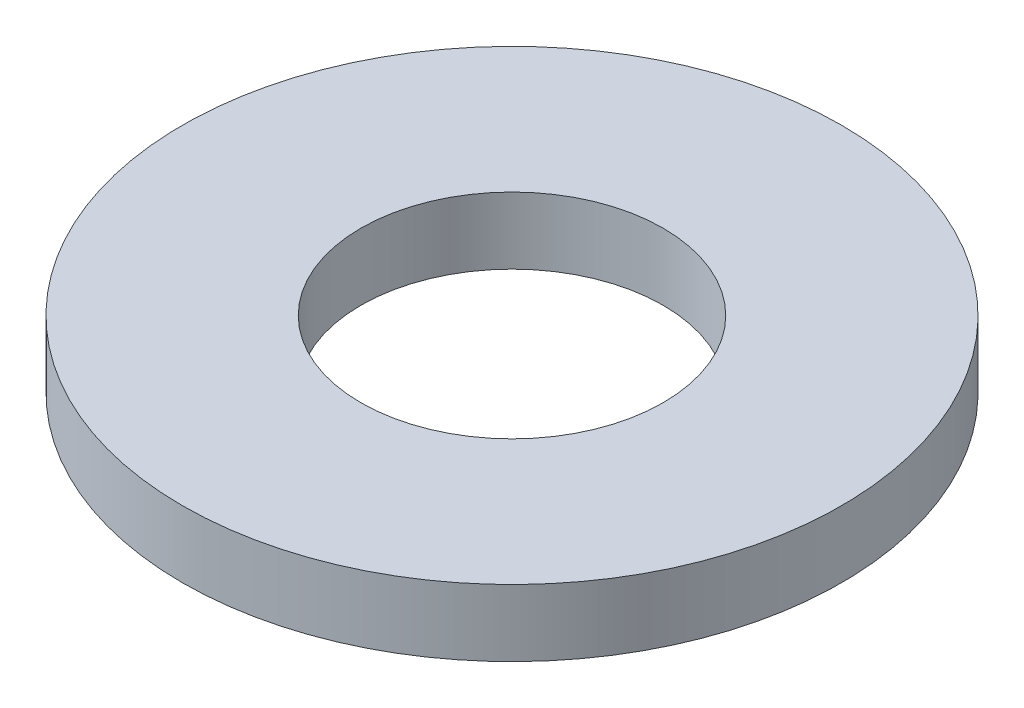
ISO-10303-21;
HEADER;
FILE_DESCRIPTION(('STEP AP214'),'2;1');
FILE_NAME('part.step','',(''),(''),'','','');
FILE_SCHEMA(('AUTOMOTIVE_DESIGN { 1 0 10303 214 1 1 1 1 }'));
ENDSEC;
DATA;
#1=APPLICATION_CONTEXT('core data for automotive mechanical design processes');
#2=APPLICATION_PROTOCOL_DEFINITION('international standard','automotive_design',2000,#1);
#3=PRODUCT_CONTEXT('',#1,'mechanical');
#4=PRODUCT('Part','Part','',(#3));
#5=PRODUCT_RELATED_PRODUCT_CATEGORY('part','',(#4));
#6=PRODUCT_DEFINITION_FORMATION('','',#4);
#7=PRODUCT_DEFINITION_CONTEXT('part definition',#1,'design');
#8=PRODUCT_DEFINITION('design','',#6,#7);
#9=PRODUCT_DEFINITION_SHAPE('','',#8);
#10=(LENGTH_UNIT() NAMED_UNIT(*) SI_UNIT(.MILLI.,.METRE.));
#11=(NAMED_UNIT(*) PLANE_ANGLE_UNIT() SI_UNIT($,.RADIAN.));
#12=(NAMED_UNIT(*) SI_UNIT($,.STERADIAN.) SOLID_ANGLE_UNIT());
#13=UNCERTAINTY_MEASURE_WITH_UNIT(LENGTH_MEASURE(1.E-05),#10,'distance_accuracy_value','');
#14=(GEOMETRIC_REPRESENTATION_CONTEXT(3) GLOBAL_UNCERTAINTY_ASSIGNED_CONTEXT((#13)) GLOBAL_UNIT_ASSIGNED_CONTEXT((#10,
#11,#12)) REPRESENTATION_CONTEXT('',''));
#15=CARTESIAN_POINT('',(0.,0.,0.));
#16=DIRECTION('',(0.,0.,1.));
#17=DIRECTION('',(1.,0.,0.));
#18=AXIS2_PLACEMENT_3D('',#15,#16,#17);
#19=CARTESIAN_POINT('',(0.,0.9652,0.));
#20=DIRECTION('',(0.,-1.,0.));
#21=DIRECTION('',(0.,0.,-1.));
#22=AXIS2_PLACEMENT_3D('',#19,#20,#21);
#23=CYLINDRICAL_SURFACE('',#22,4.7625);
#24=CARTESIAN_POINT('',(0.,0.9652,0.));
#25=DIRECTION('',(0.,1.,0.));
#26=DIRECTION('',(0.,0.,1.));
#27=AXIS2_PLACEMENT_3D('',#24,#25,#26);
#28=CIRCLE('',#27,4.7625);
#29=CARTESIAN_POINT('',(0.,0.9652,4.7625));
#30=VERTEX_POINT('',#29);
#31=EDGE_CURVE('E10',#30,#30,#28,.T.);
#32=ORIENTED_EDGE('',*,*,#31,.F.);
#33=EDGE_LOOP('',(#32));
#34=FACE_BOUND('',#33,.T.);
#35=CARTESIAN_POINT('',(0.,0.,0.));
#36=DIRECTION('',(0.,1.,0.));
#37=DIRECTION('',(0.,0.,1.));
#38=AXIS2_PLACEMENT_3D('',#35,#36,#37);
#39=CIRCLE('',#38,4.7625);
#40=CARTESIAN_POINT('',(0.,0.,4.7625));
#41=VERTEX_POINT('',#40);
#42=EDGE_CURVE('E36',#41,#41,#39,.T.);
#43=ORIENTED_EDGE('',*,*,#42,.T.);
#44=EDGE_LOOP('',(#43));
#45=FACE_BOUND('',#44,.T.);
#46=ADVANCED_FACE('F33',(#34,#45),#23,.T.);
#47=CARTESIAN_POINT('',(0.,0.9652,0.));
#48=DIRECTION('',(0.,1.,0.));
#49=DIRECTION('',(0.,0.,1.));
#50=AXIS2_PLACEMENT_3D('',#47,#48,#49);
#51=PLANE('',#50);
#52=CARTESIAN_POINT('',(0.,0.9652,0.));
#53=DIRECTION('',(0.,1.,0.));
#54=DIRECTION('',(0.,0.,1.));
#55=AXIS2_PLACEMENT_3D('',#52,#53,#54);
#56=CIRCLE('',#55,2.1844);
#57=CARTESIAN_POINT('',(0.,0.9652,2.1844));
#58=VERTEX_POINT('',#57);
#59=EDGE_CURVE('E45',#58,#58,#56,.T.);
#60=ORIENTED_EDGE('',*,*,#59,.F.);
#61=EDGE_LOOP('',(#60));
#62=FACE_BOUND('',#61,.T.);
#63=ORIENTED_EDGE('',*,*,#31,.T.);
#64=EDGE_LOOP('',(#63));
#65=FACE_BOUND('',#64,.T.);
#66=ADVANCED_FACE('F60',(#62,#65),#51,.T.);
#67=CARTESIAN_POINT('',(0.,0.,0.));
#68=DIRECTION('',(0.,1.,0.));
#69=DIRECTION('',(0.,0.,1.));
#70=AXIS2_PLACEMENT_3D('',#67,#68,#69);
#71=PLANE('',#70);
#72=CARTESIAN_POINT('',(0.,0.,0.));
#73=DIRECTION('',(0.,1.,0.));
#74=DIRECTION('',(0.,0.,1.));
#75=AXIS2_PLACEMENT_3D('',#72,#73,#74);
#76=CIRCLE('',#75,2.1844);
#77=CARTESIAN_POINT('',(0.,0.,2.1844));
#78=VERTEX_POINT('',#77);
#79=EDGE_CURVE('E43',#78,#78,#76,.T.);
#80=ORIENTED_EDGE('',*,*,#79,.T.);
#81=EDGE_LOOP('',(#80));
#82=FACE_BOUND('',#81,.T.);
#83=ORIENTED_EDGE('',*,*,#42,.F.);
#84=EDGE_LOOP('',(#83));
#85=FACE_BOUND('',#84,.T.);
#86=ADVANCED_FACE('F51',(#82,#85),#71,.F.);
#87=CARTESIAN_POINT('',(0.,0.,0.));
#88=DIRECTION('',(0.,1.,0.));
#89=DIRECTION('',(0.,0.,1.));
#90=AXIS2_PLACEMENT_3D('',#87,#88,#89);
#91=CYLINDRICAL_SURFACE('',#90,2.1844);
#92=ORIENTED_EDGE('',*,*,#79,.F.);
#93=EDGE_LOOP('',(#92));
#94=FACE_BOUND('',#93,.T.);
#95=ORIENTED_EDGE('',*,*,#59,.T.);
#96=EDGE_LOOP('',(#95));
#97=FACE_BOUND('',#96,.T.);
#98=ADVANCED_FACE('F54',(#94,#97),#91,.F.);
#99=CLOSED_SHELL('',(#46,#66,#86,#98));
#100=MANIFOLD_SOLID_BREP('B2',#99);
#101=ADVANCED_BREP_SHAPE_REPRESENTATION('',(#18,#100),#14);
#102=SHAPE_DEFINITION_REPRESENTATION(#9,#101);
ENDSEC;
END-ISO-10303-21;
